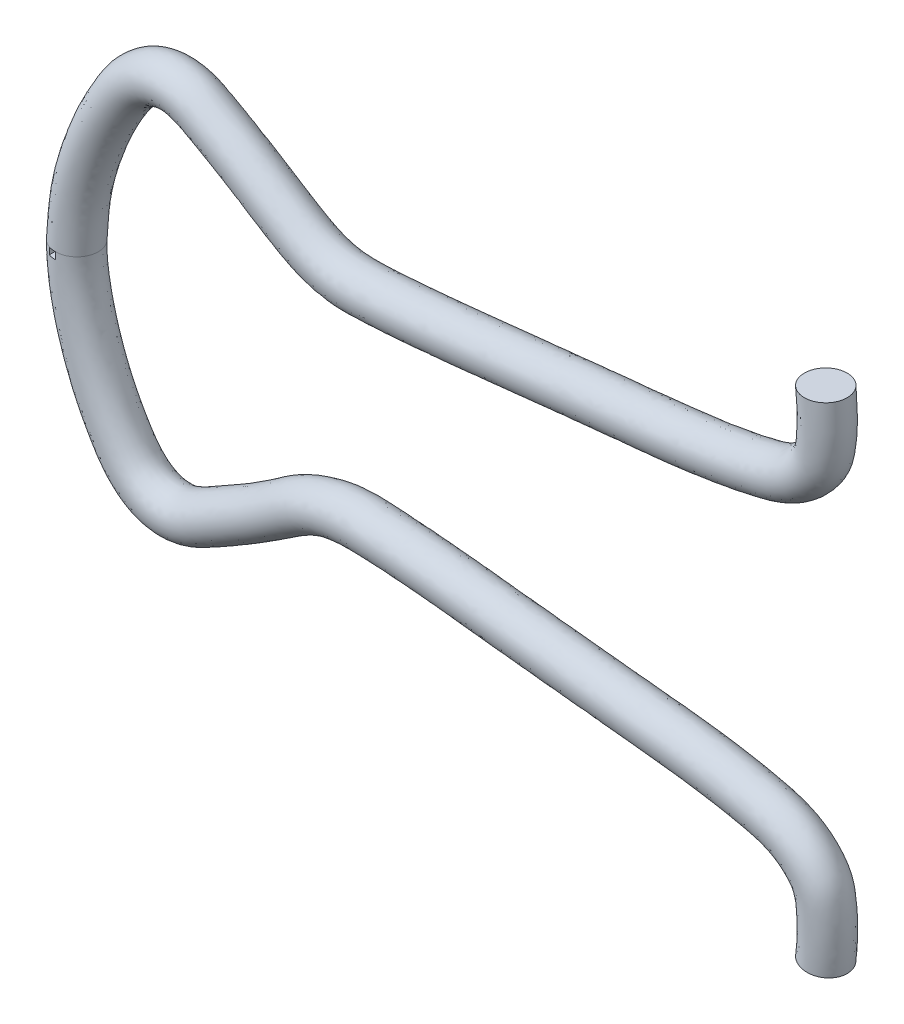
ISO-10303-21;
HEADER;
FILE_DESCRIPTION(('STEP AP214'),'2;1');
FILE_NAME('part.step','',(''),(''),'','','');
FILE_SCHEMA(('AUTOMOTIVE_DESIGN { 1 0 10303 214 1 1 1 1 }'));
ENDSEC;
DATA;
#1=APPLICATION_CONTEXT('core data for automotive mechanical design processes');
#2=APPLICATION_PROTOCOL_DEFINITION('international standard','automotive_design',2000,#1);
#3=PRODUCT_CONTEXT('',#1,'mechanical');
#4=PRODUCT('Part','Part','',(#3));
#5=PRODUCT_RELATED_PRODUCT_CATEGORY('part','',(#4));
#6=PRODUCT_DEFINITION_FORMATION('','',#4);
#7=PRODUCT_DEFINITION_CONTEXT('part definition',#1,'design');
#8=PRODUCT_DEFINITION('design','',#6,#7);
#9=PRODUCT_DEFINITION_SHAPE('','',#8);
#10=(LENGTH_UNIT() NAMED_UNIT(*) SI_UNIT(.MILLI.,.METRE.));
#11=(NAMED_UNIT(*) PLANE_ANGLE_UNIT() SI_UNIT($,.RADIAN.));
#12=(NAMED_UNIT(*) SI_UNIT($,.STERADIAN.) SOLID_ANGLE_UNIT());
#13=UNCERTAINTY_MEASURE_WITH_UNIT(LENGTH_MEASURE(1.E-05),#10,'distance_accuracy_value','');
#14=(GEOMETRIC_REPRESENTATION_CONTEXT(3) GLOBAL_UNCERTAINTY_ASSIGNED_CONTEXT((#13)) GLOBAL_UNIT_ASSIGNED_CONTEXT((#10,
#11,#12)) REPRESENTATION_CONTEXT('',''));
#15=CARTESIAN_POINT('',(0.,0.,0.));
#16=DIRECTION('',(0.,0.,1.));
#17=DIRECTION('',(1.,0.,0.));
#18=AXIS2_PLACEMENT_3D('',#15,#16,#17);
#19=CARTESIAN_POINT('',(-31.85024051314,-0.739097488164255,0.500000000000001));
#20=CARTESIAN_POINT('',(-31.8552836514389,-1.08239667611665,0.500000000000001));
#21=CARTESIAN_POINT('',(-31.762998352297,-1.82891605051562,0.500000000000001));
#22=CARTESIAN_POINT('',(-31.4962403182843,-2.75116930594545,0.500000000000001));
#23=CARTESIAN_POINT('',(-31.1759950504245,-3.5133129920374,0.500000000000001));
#24=CARTESIAN_POINT('',(-30.8753990149459,-4.06797425683743,0.500000000000001));
#25=CARTESIAN_POINT('',(-30.5438551123552,-4.59312531108531,0.500000000000001));
#26=CARTESIAN_POINT('',(-30.1407518570774,-4.92986578830265,0.500000000000001));
#27=CARTESIAN_POINT('',(-29.7519104905496,-5.05477061998919,0.500000000000001));
#28=CARTESIAN_POINT('',(-29.434703656947,-5.07208801477055,0.500000000000001));
#29=CARTESIAN_POINT('',(-29.1064110838216,-4.99467848917008,0.500000000000001));
#30=CARTESIAN_POINT('',(-28.7910258545782,-4.83290003807697,0.500000000000001));
#31=CARTESIAN_POINT('',(-28.1448465375935,-4.47368378659672,0.500000000000001));
#32=CARTESIAN_POINT('',(-27.3499380904424,-4.00696426362659,0.500000000000001));
#33=CARTESIAN_POINT('',(-26.4591769418779,-3.36125254782962,0.500000000000001));
#34=CARTESIAN_POINT('',(-25.5814715165167,-3.09137367913693,0.500000000000001));
#35=CARTESIAN_POINT('',(-24.0326679214186,-3.14931242023839,0.500000000000001));
#36=CARTESIAN_POINT('',(-21.8522938980267,-3.39559727821309,0.500000000000001));
#37=CARTESIAN_POINT('',(-18.8705827000946,-3.71590053426215,0.500000000000001));
#38=CARTESIAN_POINT('',(-16.6992209430342,-3.91923704277046,0.500000000000001));
#39=CARTESIAN_POINT('',(-15.4052937301609,-4.24688618944392,0.500000000000001));
#40=CARTESIAN_POINT('',(-15.0842496913342,-4.38022003763113,0.500000000000001));
#41=CARTESIAN_POINT('',(-14.8001560399814,-4.56601615733175,0.500000000000001));
#42=CARTESIAN_POINT('',(-14.5688398215693,-4.79232220348142,0.500000000000001));
#43=CARTESIAN_POINT('',(-14.3632827133004,-5.09906135302469,0.500000000000001));
#44=CARTESIAN_POINT('',(-14.3159188881753,-5.51757961624325,0.500000000000001));
#45=CARTESIAN_POINT('',(-14.2937130072287,-6.01054136016181,0.500000000000001));
#46=CARTESIAN_POINT('',(-14.3172112254019,-6.35500459542826,0.500000000000001));
#47=CARTESIAN_POINT('',(-14.3394388093002,-6.53926497638514,0.500000000000001));
#48=CARTESIAN_POINT('',(-32.855816893968,-0.739097488164255,0.499999999999999));
#49=CARTESIAN_POINT('',(-32.8608600322669,-1.08239667611665,0.499999999999999));
#50=CARTESIAN_POINT('',(-32.7461859213861,-2.11009620193032,0.499999999999999));
#51=CARTESIAN_POINT('',(-32.4436964154244,-3.08547609316605,0.499999999999999));
#52=CARTESIAN_POINT('',(-32.0815147340565,-3.95796491711765,0.499999999999999));
#53=CARTESIAN_POINT('',(-31.7289888008618,-4.59345533048722,0.499999999999999));
#54=CARTESIAN_POINT('',(-31.3597331451799,-5.21162386501684,0.499999999999999));
#55=CARTESIAN_POINT('',(-30.6398673090752,-5.83339109159899,0.499999999999999));
#56=CARTESIAN_POINT('',(-29.9282124544286,-6.05490192139046,0.499999999999999));
#57=CARTESIAN_POINT('',(-29.3373934949348,-6.08865817660507,0.499999999999999));
#58=CARTESIAN_POINT('',(-28.7089531632595,-5.92875474113626,0.499999999999999));
#59=CARTESIAN_POINT('',(-28.2930278474639,-5.70507262239239,0.499999999999999));
#60=CARTESIAN_POINT('',(-27.6386767057019,-5.34513572777799,0.499999999999999));
#61=CARTESIAN_POINT('',(-26.8261839958269,-4.85010496465445,0.499999999999999));
#62=CARTESIAN_POINT('',(-25.8558878577318,-4.20078673800262,0.499999999999999));
#63=CARTESIAN_POINT('',(-25.5370678803037,-4.12892079312087,0.499999999999999));
#64=CARTESIAN_POINT('',(-24.1716877775103,-4.12157036237866,0.499999999999999));
#65=CARTESIAN_POINT('',(-21.8999743022317,-4.41332766724705,0.499999999999999));
#66=CARTESIAN_POINT('',(-19.0664753376878,-4.69256266776707,0.499999999999999));
#67=CARTESIAN_POINT('',(-16.6392557181453,-4.96551142828545,0.499999999999999));
#68=CARTESIAN_POINT('',(-15.7111019676885,-5.20800931439875,0.499999999999999));
#69=CARTESIAN_POINT('',(-15.5489569868968,-5.2789206615397,0.499999999999999));
#70=CARTESIAN_POINT('',(-15.4293429949705,-5.35720949054591,0.499999999999999));
#71=CARTESIAN_POINT('',(-15.3383699621968,-5.45387224730796,0.499999999999999));
#72=CARTESIAN_POINT('',(-15.3226515082278,-5.47739093782235,0.499999999999999));
#73=CARTESIAN_POINT('',(-15.3305400172304,-5.51782824537994,0.499999999999999));
#74=CARTESIAN_POINT('',(-15.2986006944084,-6.04328885917275,0.499999999999999));
#75=CARTESIAN_POINT('',(-15.3154422594949,-6.23458660896315,0.499999999999999));
#76=CARTESIAN_POINT('',(-15.3376698433931,-6.41884698992003,0.499999999999999));
#77=CARTESIAN_POINT('',(-32.855816893968,-0.739097488164255,-0.500000000000002));
#78=CARTESIAN_POINT('',(-32.8608600322669,-1.08239667611665,-0.500000000000002));
#79=CARTESIAN_POINT('',(-32.7461859213861,-2.11009620193032,-0.500000000000002));
#80=CARTESIAN_POINT('',(-32.4436964154244,-3.08547609316605,-0.500000000000002));
#81=CARTESIAN_POINT('',(-32.0815147340565,-3.95796491711765,-0.500000000000002));
#82=CARTESIAN_POINT('',(-31.7289888008618,-4.59345533048722,-0.500000000000003));
#83=CARTESIAN_POINT('',(-31.3597331451799,-5.21162386501684,-0.500000000000002));
#84=CARTESIAN_POINT('',(-30.6398673090752,-5.83339109159899,-0.500000000000002));
#85=CARTESIAN_POINT('',(-29.9282124544286,-6.05490192139046,-0.500000000000002));
#86=CARTESIAN_POINT('',(-29.3373934949348,-6.08865817660507,-0.500000000000002));
#87=CARTESIAN_POINT('',(-28.7089531632595,-5.92875474113626,-0.500000000000002));
#88=CARTESIAN_POINT('',(-28.2930278474639,-5.70507262239239,-0.500000000000002));
#89=CARTESIAN_POINT('',(-27.6386767057019,-5.34513572777799,-0.500000000000002));
#90=CARTESIAN_POINT('',(-26.8261839958269,-4.85010496465445,-0.500000000000003));
#91=CARTESIAN_POINT('',(-25.8558878577318,-4.20078673800262,-0.500000000000002));
#92=CARTESIAN_POINT('',(-25.5370678803037,-4.12892079312087,-0.500000000000003));
#93=CARTESIAN_POINT('',(-24.1716877775103,-4.12157036237866,-0.500000000000002));
#94=CARTESIAN_POINT('',(-21.8999743022317,-4.41332766724705,-0.500000000000003));
#95=CARTESIAN_POINT('',(-19.0664753376878,-4.69256266776707,-0.500000000000002));
#96=CARTESIAN_POINT('',(-16.6392557181453,-4.96551142828545,-0.500000000000003));
#97=CARTESIAN_POINT('',(-15.7111019676885,-5.20800931439875,-0.500000000000002));
#98=CARTESIAN_POINT('',(-15.5489569868968,-5.2789206615397,-0.500000000000002));
#99=CARTESIAN_POINT('',(-15.4293429949705,-5.35720949054591,-0.500000000000002));
#100=CARTESIAN_POINT('',(-15.3383699621968,-5.45387224730796,-0.500000000000002));
#101=CARTESIAN_POINT('',(-15.3226515082278,-5.47739093782235,-0.500000000000002));
#102=CARTESIAN_POINT('',(-15.3305400172304,-5.51782824537994,-0.500000000000002));
#103=CARTESIAN_POINT('',(-15.2986006944084,-6.04328885917275,-0.500000000000002));
#104=CARTESIAN_POINT('',(-15.3154422594949,-6.23458660896315,-0.500000000000002));
#105=CARTESIAN_POINT('',(-15.3376698433931,-6.41884698992003,-0.500000000000002));
#106=CARTESIAN_POINT('',(-31.85024051314,-0.739097488164255,-0.500000000000001));
#107=CARTESIAN_POINT('',(-31.8552836514389,-1.08239667611665,-0.500000000000001));
#108=CARTESIAN_POINT('',(-31.762998352297,-1.82891605051562,-0.500000000000001));
#109=CARTESIAN_POINT('',(-31.4962403182843,-2.75116930594545,-0.500000000000001));
#110=CARTESIAN_POINT('',(-31.1759950504245,-3.5133129920374,-0.500000000000001));
#111=CARTESIAN_POINT('',(-30.8753990149459,-4.06797425683743,-0.500000000000001));
#112=CARTESIAN_POINT('',(-30.5438551123552,-4.59312531108531,-0.500000000000001));
#113=CARTESIAN_POINT('',(-30.1407518570774,-4.92986578830265,-0.500000000000001));
#114=CARTESIAN_POINT('',(-29.7519104905496,-5.05477061998919,-0.500000000000001));
#115=CARTESIAN_POINT('',(-29.434703656947,-5.07208801477055,-0.500000000000001));
#116=CARTESIAN_POINT('',(-29.1064110838216,-4.99467848917008,-0.500000000000001));
#117=CARTESIAN_POINT('',(-28.7910258545782,-4.83290003807697,-0.500000000000001));
#118=CARTESIAN_POINT('',(-28.1448465375935,-4.47368378659672,-0.500000000000001));
#119=CARTESIAN_POINT('',(-27.3499380904424,-4.00696426362659,-0.500000000000001));
#120=CARTESIAN_POINT('',(-26.4591769418779,-3.36125254782962,-0.500000000000001));
#121=CARTESIAN_POINT('',(-25.5814715165167,-3.09137367913693,-0.500000000000001));
#122=CARTESIAN_POINT('',(-24.0326679214186,-3.14931242023839,-0.500000000000001));
#123=CARTESIAN_POINT('',(-21.8522938980267,-3.39559727821309,-0.500000000000001));
#124=CARTESIAN_POINT('',(-18.8705827000946,-3.71590053426215,-0.500000000000001));
#125=CARTESIAN_POINT('',(-16.6992209430342,-3.91923704277046,-0.500000000000001));
#126=CARTESIAN_POINT('',(-15.4052937301609,-4.24688618944392,-0.500000000000001));
#127=CARTESIAN_POINT('',(-15.0842496913342,-4.38022003763113,-0.500000000000001));
#128=CARTESIAN_POINT('',(-14.8001560399814,-4.56601615733175,-0.500000000000001));
#129=CARTESIAN_POINT('',(-14.5688398215693,-4.79232220348142,-0.500000000000001));
#130=CARTESIAN_POINT('',(-14.3632827133004,-5.09906135302469,-0.500000000000001));
#131=CARTESIAN_POINT('',(-14.3159188881753,-5.51757961624325,-0.500000000000001));
#132=CARTESIAN_POINT('',(-14.2937130072287,-6.01054136016181,-0.500000000000001));
#133=CARTESIAN_POINT('',(-14.3172112254019,-6.35500459542826,-0.500000000000001));
#134=CARTESIAN_POINT('',(-14.3394388093002,-6.53926497638514,-0.500000000000001));
#135=CARTESIAN_POINT('',(-30.844664132312,-0.739097488164255,-0.499999999999999));
#136=CARTESIAN_POINT('',(-30.8497072706109,-1.08239667611665,-0.499999999999999));
#137=CARTESIAN_POINT('',(-30.7798107832079,-1.5477358991009,-0.499999999999999));
#138=CARTESIAN_POINT('',(-30.5487842211442,-2.41686251872486,-0.499999999999999));
#139=CARTESIAN_POINT('',(-30.2704753667924,-3.06866106695715,-0.499999999999999));
#140=CARTESIAN_POINT('',(-30.0218092290299,-3.54249318318764,-0.499999999999999));
#141=CARTESIAN_POINT('',(-29.7279770795306,-3.97462675715379,-0.499999999999999));
#142=CARTESIAN_POINT('',(-29.6416364050797,-4.02634048500629,-0.499999999999999));
#143=CARTESIAN_POINT('',(-29.5756085266706,-4.05463931858793,-0.499999999999999));
#144=CARTESIAN_POINT('',(-29.5320138189591,-4.05551785293601,-0.499999999999999));
#145=CARTESIAN_POINT('',(-29.5038690043837,-4.0606022372039,-0.499999999999999));
#146=CARTESIAN_POINT('',(-29.2890238616924,-3.96072745376155,-0.499999999999999));
#147=CARTESIAN_POINT('',(-28.6510163694851,-3.60223184541546,-0.499999999999999));
#148=CARTESIAN_POINT('',(-27.8736921850578,-3.16382356259872,-0.499999999999999));
#149=CARTESIAN_POINT('',(-27.062466026024,-2.52171835765664,-0.499999999999999));
#150=CARTESIAN_POINT('',(-25.6258751527298,-2.05382656515296,-0.499999999999999));
#151=CARTESIAN_POINT('',(-23.8936480653268,-2.17705447809813,-0.499999999999999));
#152=CARTESIAN_POINT('',(-21.8046134938217,-2.37786688917913,-0.499999999999999));
#153=CARTESIAN_POINT('',(-18.6746900625013,-2.73923840075723,-0.499999999999999));
#154=CARTESIAN_POINT('',(-16.7591861679231,-2.87296265725545,-0.499999999999999));
#155=CARTESIAN_POINT('',(-15.0994854926332,-3.28576306448908,-0.499999999999999));
#156=CARTESIAN_POINT('',(-14.6195423957717,-3.48151941372254,-0.499999999999999));
#157=CARTESIAN_POINT('',(-14.1709690849923,-3.77482282411758,-0.499999999999999));
#158=CARTESIAN_POINT('',(-13.7993096809417,-4.13077215965487,-0.499999999999999));
#159=CARTESIAN_POINT('',(-13.4039139183731,-4.72073176822702,-0.499999999999999));
#160=CARTESIAN_POINT('',(-13.3012977591202,-5.51733098710657,-0.499999999999999));
#161=CARTESIAN_POINT('',(-13.2888253200491,-5.97779386115087,-0.499999999999999));
#162=CARTESIAN_POINT('',(-13.318980191309,-6.47542258189337,-0.499999999999999));
#163=CARTESIAN_POINT('',(-13.3412077752072,-6.65968296285025,-0.499999999999999));
#164=CARTESIAN_POINT('',(-30.844664132312,-0.739097488164255,0.500000000000002));
#165=CARTESIAN_POINT('',(-30.8497072706109,-1.08239667611665,0.500000000000002));
#166=CARTESIAN_POINT('',(-30.7798107832079,-1.5477358991009,0.500000000000002));
#167=CARTESIAN_POINT('',(-30.5487842211442,-2.41686251872486,0.500000000000002));
#168=CARTESIAN_POINT('',(-30.2704753667924,-3.06866106695715,0.500000000000002));
#169=CARTESIAN_POINT('',(-30.0218092290299,-3.54249318318764,0.500000000000003));
#170=CARTESIAN_POINT('',(-29.7279770795306,-3.97462675715379,0.500000000000002));
#171=CARTESIAN_POINT('',(-29.6416364050797,-4.02634048500629,0.500000000000002));
#172=CARTESIAN_POINT('',(-29.5756085266706,-4.05463931858793,0.500000000000002));
#173=CARTESIAN_POINT('',(-29.5320138189591,-4.05551785293601,0.500000000000002));
#174=CARTESIAN_POINT('',(-29.5038690043837,-4.0606022372039,0.500000000000002));
#175=CARTESIAN_POINT('',(-29.2890238616924,-3.96072745376155,0.500000000000002));
#176=CARTESIAN_POINT('',(-28.6510163694851,-3.60223184541546,0.500000000000002));
#177=CARTESIAN_POINT('',(-27.8736921850578,-3.16382356259872,0.500000000000003));
#178=CARTESIAN_POINT('',(-27.062466026024,-2.52171835765664,0.500000000000002));
#179=CARTESIAN_POINT('',(-25.6258751527298,-2.05382656515296,0.500000000000002));
#180=CARTESIAN_POINT('',(-23.8936480653268,-2.17705447809813,0.500000000000002));
#181=CARTESIAN_POINT('',(-21.8046134938217,-2.37786688917913,0.500000000000003));
#182=CARTESIAN_POINT('',(-18.6746900625013,-2.73923840075723,0.500000000000002));
#183=CARTESIAN_POINT('',(-16.7591861679231,-2.87296265725545,0.500000000000003));
#184=CARTESIAN_POINT('',(-15.0994854926332,-3.28576306448908,0.500000000000002));
#185=CARTESIAN_POINT('',(-14.6195423957717,-3.48151941372254,0.500000000000002));
#186=CARTESIAN_POINT('',(-14.1709690849923,-3.77482282411758,0.500000000000002));
#187=CARTESIAN_POINT('',(-13.7993096809417,-4.13077215965487,0.500000000000002));
#188=CARTESIAN_POINT('',(-13.4039139183731,-4.72073176822702,0.500000000000002));
#189=CARTESIAN_POINT('',(-13.3012977591202,-5.51733098710657,0.500000000000002));
#190=CARTESIAN_POINT('',(-13.2888253200491,-5.97779386115087,0.500000000000002));
#191=CARTESIAN_POINT('',(-13.318980191309,-6.47542258189337,0.500000000000002));
#192=CARTESIAN_POINT('',(-13.3412077752072,-6.65968296285025,0.500000000000002));
#193=CARTESIAN_POINT('',(-31.85024051314,-0.739097488164255,0.500000000000001));
#194=CARTESIAN_POINT('',(-31.8552836514389,-1.08239667611665,0.500000000000001));
#195=CARTESIAN_POINT('',(-31.762998352297,-1.82891605051562,0.500000000000001));
#196=CARTESIAN_POINT('',(-31.4962403182843,-2.75116930594545,0.500000000000001));
#197=CARTESIAN_POINT('',(-31.1759950504245,-3.5133129920374,0.500000000000001));
#198=CARTESIAN_POINT('',(-30.8753990149459,-4.06797425683743,0.500000000000001));
#199=CARTESIAN_POINT('',(-30.5438551123552,-4.59312531108531,0.500000000000001));
#200=CARTESIAN_POINT('',(-30.1407518570774,-4.92986578830265,0.500000000000001));
#201=CARTESIAN_POINT('',(-29.7519104905496,-5.05477061998919,0.500000000000001));
#202=CARTESIAN_POINT('',(-29.434703656947,-5.07208801477055,0.500000000000001));
#203=CARTESIAN_POINT('',(-29.1064110838216,-4.99467848917008,0.500000000000001));
#204=CARTESIAN_POINT('',(-28.7910258545782,-4.83290003807697,0.500000000000001));
#205=CARTESIAN_POINT('',(-28.1448465375935,-4.47368378659672,0.500000000000001));
#206=CARTESIAN_POINT('',(-27.3499380904424,-4.00696426362659,0.500000000000001));
#207=CARTESIAN_POINT('',(-26.4591769418779,-3.36125254782962,0.500000000000001));
#208=CARTESIAN_POINT('',(-25.5814715165167,-3.09137367913693,0.500000000000001));
#209=CARTESIAN_POINT('',(-24.0326679214186,-3.14931242023839,0.500000000000001));
#210=CARTESIAN_POINT('',(-21.8522938980267,-3.39559727821309,0.500000000000001));
#211=CARTESIAN_POINT('',(-18.8705827000946,-3.71590053426215,0.500000000000001));
#212=CARTESIAN_POINT('',(-16.6992209430342,-3.91923704277046,0.500000000000001));
#213=CARTESIAN_POINT('',(-15.4052937301609,-4.24688618944392,0.500000000000001));
#214=CARTESIAN_POINT('',(-15.0842496913342,-4.38022003763113,0.500000000000001));
#215=CARTESIAN_POINT('',(-14.8001560399814,-4.56601615733175,0.500000000000001));
#216=CARTESIAN_POINT('',(-14.5688398215693,-4.79232220348142,0.500000000000001));
#217=CARTESIAN_POINT('',(-14.3632827133004,-5.09906135302469,0.500000000000001));
#218=CARTESIAN_POINT('',(-14.3159188881753,-5.51757961624325,0.500000000000001));
#219=CARTESIAN_POINT('',(-14.2937130072287,-6.01054136016181,0.500000000000001));
#220=CARTESIAN_POINT('',(-14.3172112254019,-6.35500459542826,0.500000000000001));
#221=CARTESIAN_POINT('',(-14.3394388093002,-6.53926497638514,0.500000000000001));
#222=(BOUNDED_SURFACE() B_SPLINE_SURFACE(3,3,((#19,#20,#21,#22,#23,#24,#25,#26,#27,#28,#29,#30,
#31,#32,#33,#34,#35,#36,#37,#38,#39,#40,#41,#42,#43,#44,#45,#46,#47),(#48,#49,#50,#51,#52,#53,
#54,#55,#56,#57,#58,#59,#60,#61,#62,#63,#64,#65,#66,#67,#68,#69,#70,#71,#72,#73,#74,#75,#76),
(#77,#78,#79,#80,#81,#82,#83,#84,#85,#86,#87,#88,#89,#90,#91,#92,#93,#94,#95,#96,#97,#98,#99,
#100,#101,#102,#103,#104,#105),(#106,#107,#108,#109,#110,#111,#112,#113,#114,#115,#116,#117,
#118,#119,#120,#121,#122,#123,#124,#125,#126,#127,#128,#129,#130,#131,#132,#133,#134),(#135,
#136,#137,#138,#139,#140,#141,#142,#143,#144,#145,#146,#147,#148,#149,#150,#151,#152,#153,#154,
#155,#156,#157,#158,#159,#160,#161,#162,#163),(#164,#165,#166,#167,#168,#169,#170,#171,#172,
#173,#174,#175,#176,#177,#178,#179,#180,#181,#182,#183,#184,#185,#186,#187,#188,#189,#190,#191,
#192),(#193,#194,#195,#196,#197,#198,#199,#200,#201,#202,#203,#204,#205,#206,#207,#208,#209,
#210,#211,#212,#213,#214,#215,#216,#217,#218,#219,#220,#221)),.UNSPECIFIED.,.T.,.F.,
.F.) B_SPLINE_SURFACE_WITH_KNOTS((4,3,4),(4,1,1,1,1,1,1,1,1,1,1,1,1,1,1,1,1,1,1,1,1,1,1,1,1,1,
4),(0.,0.5,1.),(0.,0.0453080663909508,0.0984238556094882,0.126301054122408,0.154230019640889,
0.18162996670079,0.207998463452138,0.221300453837338,0.234929916301715,0.249422386694303,
0.265217720548691,0.281542247278561,0.347049926004407,0.386829289422081,0.426042239288472,
0.465314949180757,0.590141791791185,0.71605840505547,0.861263029247658,0.876769672795154,
0.891970414615276,0.90691782362175,0.921248219665531,0.934536313034606,0.954674024957773,
0.975507958500653,1.),
.UNSPECIFIED.) GEOMETRIC_REPRESENTATION_ITEM() RATIONAL_B_SPLINE_SURFACE(((1.,1.,1.,1.,1.,1.,1.,
1.,1.,1.,1.,1.,1.,1.,1.,1.,1.,1.,1.,1.,1.,1.,1.,1.,1.,1.,1.,1.,1.),(0.333333333333333,
0.333333333333333,0.333333333333333,0.333333333333333,0.333333333333333,0.333333333333333,
0.333333333333333,0.333333333333333,0.333333333333333,0.333333333333333,0.333333333333333,
0.333333333333333,0.333333333333333,0.333333333333333,0.333333333333333,0.333333333333333,
0.333333333333333,0.333333333333333,0.333333333333334,0.333333333333333,0.333333333333333,
0.333333333333333,0.333333333333333,0.333333333333333,0.333333333333333,0.333333333333333,
0.333333333333333,0.333333333333333,0.333333333333333),(0.333333333333333,0.333333333333333,
0.333333333333333,0.333333333333333,0.333333333333333,0.333333333333333,0.333333333333333,
0.333333333333333,0.333333333333333,0.333333333333333,0.333333333333333,0.333333333333333,
0.333333333333333,0.333333333333333,0.333333333333333,0.333333333333333,0.333333333333333,
0.333333333333333,0.333333333333334,0.333333333333333,0.333333333333333,0.333333333333333,
0.333333333333333,0.333333333333333,0.333333333333333,0.333333333333333,0.333333333333333,
0.333333333333333,0.333333333333333),(1.,1.,1.,1.,1.,1.,1.,1.,1.,1.,1.,1.,1.,1.,1.,1.,1.,1.,1.,
1.,1.,1.,1.,1.,1.,1.,1.,1.,1.),(0.333333333333333,0.333333333333333,0.333333333333333,
0.333333333333333,0.333333333333333,0.333333333333333,0.333333333333333,0.333333333333333,
0.333333333333333,0.333333333333333,0.333333333333333,0.333333333333333,0.333333333333333,
0.333333333333333,0.333333333333333,0.333333333333333,0.333333333333333,0.333333333333333,
0.333333333333334,0.333333333333333,0.333333333333333,0.333333333333333,0.333333333333333,
0.333333333333333,0.333333333333333,0.333333333333333,0.333333333333333,0.333333333333333,
0.333333333333333),(0.333333333333333,0.333333333333333,0.333333333333333,0.333333333333333,
0.333333333333333,0.333333333333333,0.333333333333333,0.333333333333333,0.333333333333333,
0.333333333333333,0.333333333333333,0.333333333333333,0.333333333333333,0.333333333333333,
0.333333333333333,0.333333333333333,0.333333333333333,0.333333333333333,0.333333333333334,
0.333333333333333,0.333333333333333,0.333333333333333,0.333333333333333,0.333333333333333,
0.333333333333333,0.333333333333333,0.333333333333333,0.333333333333333,0.333333333333333),(1.,
1.,1.,1.,1.,1.,1.,1.,1.,1.,1.,1.,1.,1.,1.,1.,1.,1.,1.,1.,1.,1.,1.,1.,1.,1.,1.,1.,1.))) REPRESENTATION_ITEM('') SURFACE());
#223=CARTESIAN_POINT('',(-14.3394388093002,-6.53926497638514,0.500000000000001));
#224=CARTESIAN_POINT('',(-15.3376698433931,-6.41884698992003,0.499999999999999));
#225=CARTESIAN_POINT('',(-15.3376698433931,-6.41884698992003,-0.500000000000002));
#226=CARTESIAN_POINT('',(-14.3394388093002,-6.53926497638514,-0.500000000000001));
#227=CARTESIAN_POINT('',(-13.3412077752072,-6.65968296285025,-0.499999999999999));
#228=CARTESIAN_POINT('',(-13.3412077752072,-6.65968296285025,0.500000000000002));
#229=CARTESIAN_POINT('',(-14.3394388093002,-6.53926497638514,0.500000000000001));
#230=(BOUNDED_CURVE() B_SPLINE_CURVE(3,(#223,#224,#225,#226,#227,#228,#229),.UNSPECIFIED.,.T.,
.F.) B_SPLINE_CURVE_WITH_KNOTS((4,3,4),(0.,0.5,1.),
.UNSPECIFIED.) CURVE() GEOMETRIC_REPRESENTATION_ITEM() RATIONAL_B_SPLINE_CURVE((1.,
0.333333333333333,0.333333333333333,1.,0.333333333333333,0.333333333333333,1.)) REPRESENTATION_ITEM(''));
#231=CARTESIAN_POINT('',(-14.3394388093002,-6.53926497638514,0.500000000000001));
#232=VERTEX_POINT('',#231);
#233=EDGE_CURVE('E88',#232,#232,#230,.F.);
#234=CARTESIAN_POINT('',(-31.85024051314,-0.900710289289549,0.499998913472939));
#235=CARTESIAN_POINT('',(-31.8792338995687,-0.900710289289549,0.499904339239247));
#236=CARTESIAN_POINT('',(-31.9078072658661,-0.900710289289549,0.497401733195915));
#237=CARTESIAN_POINT('',(-31.9641139581979,-0.900710289289549,0.487580457489969));
#238=CARTESIAN_POINT('',(-31.9918472842325,-0.900710289289549,0.480261787827354));
#239=CARTESIAN_POINT('',(-32.0191605901357,-0.900710289289549,0.470535086355099));
#240=B_SPLINE_CURVE_WITH_KNOTS('',3,(#234,#235,#236,#237,#238,#239),.UNSPECIFIED.,.F.,.F.,(4,2,
4),(0.,0.0860482578970775,0.172096515794165),.UNSPECIFIED.);
#241=CARTESIAN_POINT('',(-31.85024051314,-0.900710289289549,0.499998913472939));
#242=VERTEX_POINT('',#241);
#243=CARTESIAN_POINT('',(-32.0191605901357,-0.900710289289549,0.470535086355097));
#244=VERTEX_POINT('',#243);
#245=EDGE_CURVE('E51',#242,#244,#240,.T.);
#246=CARTESIAN_POINT('',(-32.0191605901357,-0.900710289289549,0.470535086355097));
#247=CARTESIAN_POINT('',(-32.0191605901357,-0.87377532710775,0.470805026393329));
#248=CARTESIAN_POINT('',(-32.0191605901357,-0.846840112589742,0.470973483926086));
#249=CARTESIAN_POINT('',(-32.0191605901357,-0.792969178881311,0.47110743398065));
#250=CARTESIAN_POINT('',(-32.0191605901357,-0.766033459690887,0.471072926502457));
#251=CARTESIAN_POINT('',(-32.0191605901357,-0.739097488164255,0.470936936518789));
#252=B_SPLINE_CURVE_WITH_KNOTS('',3,(#246,#247,#248,#249,#250,#251),.UNSPECIFIED.,.F.,.F.,(4,2,
4),(0.,0.0808072238827864,0.161614447765573),.UNSPECIFIED.);
#253=CARTESIAN_POINT('',(-32.0191605901357,-0.739097488164272,0.470936936518791));
#254=VERTEX_POINT('',#253);
#255=EDGE_CURVE('E11',#244,#254,#252,.T.);
#256=CARTESIAN_POINT('',(-31.85024051314,-0.739097488164272,0.500000000000001));
#257=CARTESIAN_POINT('',(-30.844664132312,-0.739097488164272,0.500000000000002));
#258=CARTESIAN_POINT('',(-30.844664132312,-0.739097488164272,-0.499999999999999));
#259=CARTESIAN_POINT('',(-31.85024051314,-0.739097488164272,-0.500000000000001));
#260=CARTESIAN_POINT('',(-32.855816893968,-0.739097488164272,-0.500000000000002));
#261=CARTESIAN_POINT('',(-32.855816893968,-0.739097488164272,0.499999999999999));
#262=CARTESIAN_POINT('',(-31.85024051314,-0.739097488164272,0.500000000000001));
#263=(BOUNDED_CURVE() B_SPLINE_CURVE(3,(#256,#257,#258,#259,#260,#261,#262),.UNSPECIFIED.,.T.,
.F.) B_SPLINE_CURVE_WITH_KNOTS((4,3,4),(0.,0.5,1.),
.UNSPECIFIED.) CURVE() GEOMETRIC_REPRESENTATION_ITEM() RATIONAL_B_SPLINE_CURVE((1.,
0.333333333333333,0.333333333333333,1.,0.333333333333333,0.333333333333333,1.)) REPRESENTATION_ITEM(''));
#264=CARTESIAN_POINT('',(-31.85024051314,-0.739097488164272,0.500000000000001));
#265=VERTEX_POINT('',#264);
#266=EDGE_CURVE('E115',#254,#265,#263,.F.);
#267=CARTESIAN_POINT('',(-31.85024051314,-0.739097488164255,0.500000000000001));
#268=CARTESIAN_POINT('',(-31.85024051314,-0.792968421872686,0.499999637824313));
#269=CARTESIAN_POINT('',(-31.85024051314,-0.846839355581117,0.499999275648626));
#270=CARTESIAN_POINT('',(-31.85024051314,-0.900710289289548,0.499998913472939));
#271=B_SPLINE_CURVE_WITH_KNOTS('',3,(#267,#268,#269,#270),.UNSPECIFIED.,.F.,.F.,(4,4),(0.,
0.161612801128946),.UNSPECIFIED.);
#272=EDGE_CURVE('E129',#265,#242,#271,.T.);
#273=ORIENTED_EDGE('',*,*,#233,.T.);
#274=EDGE_LOOP('',(#273));
#275=FACE_BOUND('',#274,.T.);
#276=ORIENTED_EDGE('',*,*,#245,.T.);
#277=ORIENTED_EDGE('',*,*,#255,.T.);
#278=ORIENTED_EDGE('',*,*,#266,.T.);
#279=ORIENTED_EDGE('',*,*,#272,.T.);
#280=EDGE_LOOP('',(#276,#277,#278,#279));
#281=FACE_BOUND('',#280,.T.);
#282=ADVANCED_FACE('F35',(#275,#281),#222,.T.);
#283=CARTESIAN_POINT('',(-14.3394388093003,5.0610700000566,0.500000000000001));
#284=CARTESIAN_POINT('',(-14.3226369011048,4.87585362633113,0.500000000000001));
#285=CARTESIAN_POINT('',(-14.2915434940782,4.53309445700043,0.500000000000001));
#286=CARTESIAN_POINT('',(-14.3165998340043,4.03716283399738,0.500000000000001));
#287=CARTESIAN_POINT('',(-14.3632149031121,3.62114317305821,0.500000000000001));
#288=CARTESIAN_POINT('',(-14.5682955545628,3.31476114783015,0.500000000000001));
#289=CARTESIAN_POINT('',(-14.8001328153921,3.08780464432725,0.500000000000001));
#290=CARTESIAN_POINT('',(-15.0841477887947,2.90209178436403,0.500000000000001));
#291=CARTESIAN_POINT('',(-15.4052290602466,2.76870626181536,0.500000000000001));
#292=CARTESIAN_POINT('',(-16.6991187663411,2.44105910117381,0.500000000000001));
#293=CARTESIAN_POINT('',(-18.8690480411459,2.23859244204819,0.500000000000001));
#294=CARTESIAN_POINT('',(-21.8570604281007,1.91467955174071,0.500000000000001));
#295=CARTESIAN_POINT('',(-24.1001932213707,1.66953205247261,0.500000000000001));
#296=CARTESIAN_POINT('',(-25.845814600817,1.5959766927713,0.500000000000001));
#297=CARTESIAN_POINT('',(-26.8640883444268,2.17947335405573,0.500000000000001));
#298=CARTESIAN_POINT('',(-27.6402347271901,2.6877126726369,0.500000000000001));
#299=CARTESIAN_POINT('',(-28.2693337611829,3.06328842528765,0.500000000000001));
#300=CARTESIAN_POINT('',(-28.7200529265025,3.31567283747741,0.500000000000001));
#301=CARTESIAN_POINT('',(-29.156738914701,3.55113512734451,0.500000000000001));
#302=CARTESIAN_POINT('',(-29.6235658427914,3.60847620897366,0.500000000000001));
#303=CARTESIAN_POINT('',(-30.1085853111176,3.47818818606518,0.500000000000001));
#304=CARTESIAN_POINT('',(-30.5436580292458,3.1152697202054,0.500000000000001));
#305=CARTESIAN_POINT('',(-30.8753259317095,2.5897260096026,0.500000000000001));
#306=CARTESIAN_POINT('',(-31.1764051393912,2.0351321454019,0.5));
#307=CARTESIAN_POINT('',(-31.4940765415413,1.27298248895615,0.500000000000001));
#308=CARTESIAN_POINT('',(-31.7784764249727,0.350609882278038,0.500000000000001));
#309=CARTESIAN_POINT('',(-31.8276186040352,-0.395593352398396,0.500000000000001));
#310=CARTESIAN_POINT('',(-31.85024051314,-0.739097488164272,0.500000000000001));
#311=CARTESIAN_POINT('',(-13.3394388093003,5.0610700000566,0.500000000000001));
#312=CARTESIAN_POINT('',(-13.3260342543864,4.83056246152815,0.500000000000001));
#313=CARTESIAN_POINT('',(-13.3012279480372,4.40398801326915,0.500000000000001));
#314=CARTESIAN_POINT('',(-13.3143022626568,3.9204109821876,0.500000000000001));
#315=CARTESIAN_POINT('',(-13.4552050857614,3.14631112333896,0.500000000000001));
#316=CARTESIAN_POINT('',(-13.8726538279985,2.58377006080122,0.500000000000001));
#317=CARTESIAN_POINT('',(-14.2527814127606,2.2445450006871,0.500000000000001));
#318=CARTESIAN_POINT('',(-14.7053299704767,1.96987757366561,0.500000000000001));
#319=CARTESIAN_POINT('',(-15.1848217178946,1.78990562765307,0.500000000000001));
#320=CARTESIAN_POINT('',(-16.8295822447148,1.41042342428557,0.5));
#321=CARTESIAN_POINT('',(-18.7474513928644,1.25104912341622,0.500000000000001));
#322=CARTESIAN_POINT('',(-21.9033995787159,0.908331183136855,0.500000000000001));
#323=CARTESIAN_POINT('',(-23.9647206097735,0.675904634856589,0.500000000000001));
#324=CARTESIAN_POINT('',(-26.0741266723721,0.585462658943575,0.500000000000001));
#325=CARTESIAN_POINT('',(-27.5568594180182,1.42793145550721,0.500000000000002));
#326=CARTESIAN_POINT('',(-28.2154475089771,1.86963448558289,0.500000000000001));
#327=CARTESIAN_POINT('',(-28.818504810881,2.22384900258014,0.500000000000003));
#328=CARTESIAN_POINT('',(-29.2673826031648,2.47988967029696,0.500000000000002));
#329=CARTESIAN_POINT('',(-29.5690406987472,2.61295414748414,0.500000000000003));
#330=CARTESIAN_POINT('',(-29.5843642037957,2.57695658305815,0.500000000000003));
#331=CARTESIAN_POINT('',(-29.6631369443867,2.5439316588737,0.500000000000003));
#332=CARTESIAN_POINT('',(-29.7436526991601,2.47726082097618,0.500000000000003));
#333=CARTESIAN_POINT('',(-30.0332947537072,2.04898568784178,0.500000000000004));
#334=CARTESIAN_POINT('',(-30.2782398072946,1.5789304021186,0.500000000000003));
#335=CARTESIAN_POINT('',(-30.5501166925549,0.925903751416365,0.500000000000001));
#336=CARTESIAN_POINT('',(-30.793390973504,0.106120376005919,0.500000000000002));
#337=CARTESIAN_POINT('',(-30.8285014976616,-0.472662810524334,0.500000000000002));
#338=CARTESIAN_POINT('',(-30.844664132312,-0.739097488164272,0.500000000000002));
#339=CARTESIAN_POINT('',(-13.3394388093003,5.0610700000566,-0.500000000000001));
#340=CARTESIAN_POINT('',(-13.3260342543864,4.83056246152815,-0.500000000000001));
#341=CARTESIAN_POINT('',(-13.3012279480372,4.40398801326915,-0.500000000000001));
#342=CARTESIAN_POINT('',(-13.3143022626568,3.9204109821876,-0.5));
#343=CARTESIAN_POINT('',(-13.4552050857614,3.14631112333896,-0.500000000000001));
#344=CARTESIAN_POINT('',(-13.8726538279985,2.58377006080122,-0.5));
#345=CARTESIAN_POINT('',(-14.2527814127606,2.2445450006871,-0.500000000000001));
#346=CARTESIAN_POINT('',(-14.7053299704767,1.96987757366561,-0.500000000000001));
#347=CARTESIAN_POINT('',(-15.1848217178946,1.78990562765307,-0.500000000000001));
#348=CARTESIAN_POINT('',(-16.8295822447148,1.41042342428557,-0.500000000000001));
#349=CARTESIAN_POINT('',(-18.7474513928644,1.25104912341622,-0.5));
#350=CARTESIAN_POINT('',(-21.9033995787159,0.908331183136855,-0.500000000000001));
#351=CARTESIAN_POINT('',(-23.9647206097735,0.675904634856589,-0.5));
#352=CARTESIAN_POINT('',(-26.0741266723721,0.585462658943575,-0.5));
#353=CARTESIAN_POINT('',(-27.5568594180182,1.42793145550721,-0.499999999999999));
#354=CARTESIAN_POINT('',(-28.2154475089771,1.86963448558289,-0.5));
#355=CARTESIAN_POINT('',(-28.818504810881,2.22384900258014,-0.499999999999999));
#356=CARTESIAN_POINT('',(-29.2673826031648,2.47988967029696,-0.499999999999999));
#357=CARTESIAN_POINT('',(-29.5690406987472,2.61295414748414,-0.499999999999998));
#358=CARTESIAN_POINT('',(-29.5843642037957,2.57695658305815,-0.499999999999998));
#359=CARTESIAN_POINT('',(-29.6631369443867,2.5439316588737,-0.499999999999998));
#360=CARTESIAN_POINT('',(-29.7436526991601,2.47726082097618,-0.499999999999999));
#361=CARTESIAN_POINT('',(-30.0332947537072,2.04898568784178,-0.499999999999997));
#362=CARTESIAN_POINT('',(-30.2782398072946,1.5789304021186,-0.499999999999999));
#363=CARTESIAN_POINT('',(-30.5501166925549,0.925903751416365,-0.5));
#364=CARTESIAN_POINT('',(-30.793390973504,0.106120376005919,-0.5));
#365=CARTESIAN_POINT('',(-30.8285014976616,-0.472662810524334,-0.499999999999999));
#366=CARTESIAN_POINT('',(-30.844664132312,-0.739097488164272,-0.499999999999999));
#367=CARTESIAN_POINT('',(-14.3394388093003,5.0610700000566,-0.500000000000001));
#368=CARTESIAN_POINT('',(-14.3226369011048,4.87585362633113,-0.500000000000001));
#369=CARTESIAN_POINT('',(-14.2915434940782,4.53309445700043,-0.500000000000001));
#370=CARTESIAN_POINT('',(-14.3165998340043,4.03716283399738,-0.500000000000001));
#371=CARTESIAN_POINT('',(-14.3632149031121,3.62114317305821,-0.500000000000001));
#372=CARTESIAN_POINT('',(-14.5682955545628,3.31476114783015,-0.500000000000001));
#373=CARTESIAN_POINT('',(-14.8001328153921,3.08780464432725,-0.500000000000001));
#374=CARTESIAN_POINT('',(-15.0841477887947,2.90209178436403,-0.500000000000001));
#375=CARTESIAN_POINT('',(-15.4052290602466,2.76870626181536,-0.500000000000001));
#376=CARTESIAN_POINT('',(-16.6991187663411,2.44105910117381,-0.500000000000001));
#377=CARTESIAN_POINT('',(-18.8690480411459,2.23859244204819,-0.500000000000001));
#378=CARTESIAN_POINT('',(-21.8570604281007,1.91467955174071,-0.500000000000001));
#379=CARTESIAN_POINT('',(-24.1001932213707,1.66953205247261,-0.500000000000001));
#380=CARTESIAN_POINT('',(-25.845814600817,1.5959766927713,-0.500000000000001));
#381=CARTESIAN_POINT('',(-26.8640883444268,2.17947335405573,-0.500000000000001));
#382=CARTESIAN_POINT('',(-27.6402347271901,2.6877126726369,-0.500000000000001));
#383=CARTESIAN_POINT('',(-28.2693337611829,3.06328842528765,-0.500000000000001));
#384=CARTESIAN_POINT('',(-28.7200529265025,3.31567283747741,-0.500000000000001));
#385=CARTESIAN_POINT('',(-29.156738914701,3.55113512734451,-0.500000000000001));
#386=CARTESIAN_POINT('',(-29.6235658427914,3.60847620897366,-0.500000000000001));
#387=CARTESIAN_POINT('',(-30.1085853111176,3.47818818606518,-0.500000000000001));
#388=CARTESIAN_POINT('',(-30.5436580292458,3.1152697202054,-0.500000000000001));
#389=CARTESIAN_POINT('',(-30.8753259317095,2.5897260096026,-0.500000000000001));
#390=CARTESIAN_POINT('',(-31.1764051393912,2.0351321454019,-0.5));
#391=CARTESIAN_POINT('',(-31.4940765415413,1.27298248895615,-0.500000000000001));
#392=CARTESIAN_POINT('',(-31.7784764249727,0.350609882278038,-0.500000000000001));
#393=CARTESIAN_POINT('',(-31.8276186040352,-0.395593352398396,-0.500000000000001));
#394=CARTESIAN_POINT('',(-31.85024051314,-0.739097488164272,-0.500000000000001));
#395=CARTESIAN_POINT('',(-15.3394388093003,5.0610700000566,-0.500000000000001));
#396=CARTESIAN_POINT('',(-15.3192395478233,4.92114479113411,-0.500000000000001));
#397=CARTESIAN_POINT('',(-15.2818590401192,4.66220090073172,-0.500000000000001));
#398=CARTESIAN_POINT('',(-15.3188974053517,4.15391468580716,-0.500000000000001));
#399=CARTESIAN_POINT('',(-15.2712247204628,4.09597522277745,-0.500000000000001));
#400=CARTESIAN_POINT('',(-15.2639372811271,4.04575223485908,-0.500000000000001));
#401=CARTESIAN_POINT('',(-15.3474842180235,3.93106428796741,-0.500000000000001));
#402=CARTESIAN_POINT('',(-15.4629656071127,3.83430599506244,-0.500000000000001));
#403=CARTESIAN_POINT('',(-15.6256364025985,3.74750689597765,-0.500000000000001));
#404=CARTESIAN_POINT('',(-16.5686552879675,3.47169477806207,-0.5));
#405=CARTESIAN_POINT('',(-18.9906446894274,3.22613576068014,-0.500000000000001));
#406=CARTESIAN_POINT('',(-21.8107212774854,2.92102792034456,-0.500000000000001));
#407=CARTESIAN_POINT('',(-24.2356658329678,2.66315947008863,-0.500000000000001));
#408=CARTESIAN_POINT('',(-25.6175025292618,2.60649072659902,-0.500000000000001));
#409=CARTESIAN_POINT('',(-26.1713172708355,2.93101525260426,-0.500000000000002));
#410=CARTESIAN_POINT('',(-27.0650219454032,3.50579085969091,-0.500000000000001));
#411=CARTESIAN_POINT('',(-27.7201627114847,3.90272784799514,-0.500000000000003));
#412=CARTESIAN_POINT('',(-28.1727232498403,4.15145600465788,-0.500000000000003));
#413=CARTESIAN_POINT('',(-28.7444371306548,4.48931610720487,-0.500000000000003));
#414=CARTESIAN_POINT('',(-29.6627674817872,4.63999583488918,-0.500000000000003));
#415=CARTESIAN_POINT('',(-30.5540336778485,4.41244471325666,-0.500000000000003));
#416=CARTESIAN_POINT('',(-31.3436633593315,3.75327861943461,-0.500000000000003));
#417=CARTESIAN_POINT('',(-31.7173571097117,3.13046633136341,-0.500000000000004));
#418=CARTESIAN_POINT('',(-32.0745704714877,2.49133388868519,-0.500000000000003));
#419=CARTESIAN_POINT('',(-32.4380363905277,1.62006122649595,-0.500000000000002));
#420=CARTESIAN_POINT('',(-32.7635618764413,0.595099388550156,-0.500000000000002));
#421=CARTESIAN_POINT('',(-32.8267357104089,-0.318523894272458,-0.500000000000002));
#422=CARTESIAN_POINT('',(-32.855816893968,-0.739097488164272,-0.500000000000002));
#423=CARTESIAN_POINT('',(-15.3394388093003,5.0610700000566,0.500000000000001));
#424=CARTESIAN_POINT('',(-15.3192395478233,4.92114479113411,0.500000000000001));
#425=CARTESIAN_POINT('',(-15.2818590401192,4.66220090073172,0.500000000000001));
#426=CARTESIAN_POINT('',(-15.3188974053517,4.15391468580716,0.500000000000001));
#427=CARTESIAN_POINT('',(-15.2712247204628,4.09597522277745,0.500000000000001));
#428=CARTESIAN_POINT('',(-15.2639372811271,4.04575223485908,0.500000000000001));
#429=CARTESIAN_POINT('',(-15.3474842180235,3.93106428796741,0.500000000000001));
#430=CARTESIAN_POINT('',(-15.4629656071127,3.83430599506244,0.500000000000001));
#431=CARTESIAN_POINT('',(-15.6256364025985,3.74750689597765,0.5));
#432=CARTESIAN_POINT('',(-16.5686552879675,3.47169477806207,0.500000000000001));
#433=CARTESIAN_POINT('',(-18.9906446894274,3.22613576068014,0.5));
#434=CARTESIAN_POINT('',(-21.8107212774854,2.92102792034456,0.500000000000001));
#435=CARTESIAN_POINT('',(-24.2356658329678,2.66315947008863,0.5));
#436=CARTESIAN_POINT('',(-25.6175025292618,2.60649072659902,0.5));
#437=CARTESIAN_POINT('',(-26.1713172708355,2.93101525260426,0.499999999999999));
#438=CARTESIAN_POINT('',(-27.0650219454032,3.50579085969091,0.5));
#439=CARTESIAN_POINT('',(-27.7201627114847,3.90272784799514,0.499999999999999));
#440=CARTESIAN_POINT('',(-28.1727232498403,4.15145600465788,0.499999999999999));
#441=CARTESIAN_POINT('',(-28.7444371306548,4.48931610720487,0.499999999999998));
#442=CARTESIAN_POINT('',(-29.6627674817872,4.63999583488918,0.499999999999999));
#443=CARTESIAN_POINT('',(-30.5540336778485,4.41244471325666,0.499999999999998));
#444=CARTESIAN_POINT('',(-31.3436633593315,3.75327861943461,0.499999999999999));
#445=CARTESIAN_POINT('',(-31.7173571097117,3.13046633136341,0.499999999999997));
#446=CARTESIAN_POINT('',(-32.0745704714877,2.49133388868519,0.499999999999999));
#447=CARTESIAN_POINT('',(-32.4380363905277,1.62006122649595,0.5));
#448=CARTESIAN_POINT('',(-32.7635618764413,0.595099388550156,0.5));
#449=CARTESIAN_POINT('',(-32.8267357104089,-0.318523894272458,0.499999999999999));
#450=CARTESIAN_POINT('',(-32.855816893968,-0.739097488164272,0.499999999999999));
#451=CARTESIAN_POINT('',(-14.3394388093003,5.0610700000566,0.500000000000001));
#452=CARTESIAN_POINT('',(-14.3226369011048,4.87585362633113,0.500000000000001));
#453=CARTESIAN_POINT('',(-14.2915434940782,4.53309445700043,0.500000000000001));
#454=CARTESIAN_POINT('',(-14.3165998340043,4.03716283399738,0.500000000000001));
#455=CARTESIAN_POINT('',(-14.3632149031121,3.62114317305821,0.500000000000001));
#456=CARTESIAN_POINT('',(-14.5682955545628,3.31476114783015,0.500000000000001));
#457=CARTESIAN_POINT('',(-14.8001328153921,3.08780464432725,0.500000000000001));
#458=CARTESIAN_POINT('',(-15.0841477887947,2.90209178436403,0.500000000000001));
#459=CARTESIAN_POINT('',(-15.4052290602466,2.76870626181536,0.500000000000001));
#460=CARTESIAN_POINT('',(-16.6991187663411,2.44105910117381,0.500000000000001));
#461=CARTESIAN_POINT('',(-18.8690480411459,2.23859244204819,0.500000000000001));
#462=CARTESIAN_POINT('',(-21.8570604281007,1.91467955174071,0.500000000000001));
#463=CARTESIAN_POINT('',(-24.1001932213707,1.66953205247261,0.500000000000001));
#464=CARTESIAN_POINT('',(-25.845814600817,1.5959766927713,0.500000000000001));
#465=CARTESIAN_POINT('',(-26.8640883444268,2.17947335405573,0.500000000000001));
#466=CARTESIAN_POINT('',(-27.6402347271901,2.6877126726369,0.500000000000001));
#467=CARTESIAN_POINT('',(-28.2693337611829,3.06328842528765,0.500000000000001));
#468=CARTESIAN_POINT('',(-28.7200529265025,3.31567283747741,0.500000000000001));
#469=CARTESIAN_POINT('',(-29.156738914701,3.55113512734451,0.500000000000001));
#470=CARTESIAN_POINT('',(-29.6235658427914,3.60847620897366,0.500000000000001));
#471=CARTESIAN_POINT('',(-30.1085853111176,3.47818818606518,0.500000000000001));
#472=CARTESIAN_POINT('',(-30.5436580292458,3.1152697202054,0.500000000000001));
#473=CARTESIAN_POINT('',(-30.8753259317095,2.5897260096026,0.500000000000001));
#474=CARTESIAN_POINT('',(-31.1764051393912,2.0351321454019,0.5));
#475=CARTESIAN_POINT('',(-31.4940765415413,1.27298248895615,0.500000000000001));
#476=CARTESIAN_POINT('',(-31.7784764249727,0.350609882278038,0.500000000000001));
#477=CARTESIAN_POINT('',(-31.8276186040352,-0.395593352398396,0.500000000000001));
#478=CARTESIAN_POINT('',(-31.85024051314,-0.739097488164272,0.500000000000001));
#479=(BOUNDED_SURFACE() B_SPLINE_SURFACE(3,3,((#283,#284,#285,#286,#287,#288,#289,#290,#291,
#292,#293,#294,#295,#296,#297,#298,#299,#300,#301,#302,#303,#304,#305,#306,#307,#308,#309,#310),
(#311,#312,#313,#314,#315,#316,#317,#318,#319,#320,#321,#322,#323,#324,#325,#326,#327,#328,#329,
#330,#331,#332,#333,#334,#335,#336,#337,#338),(#339,#340,#341,#342,#343,#344,#345,#346,#347,
#348,#349,#350,#351,#352,#353,#354,#355,#356,#357,#358,#359,#360,#361,#362,#363,#364,#365,#366),
(#367,#368,#369,#370,#371,#372,#373,#374,#375,#376,#377,#378,#379,#380,#381,#382,#383,#384,#385,
#386,#387,#388,#389,#390,#391,#392,#393,#394),(#395,#396,#397,#398,#399,#400,#401,#402,#403,
#404,#405,#406,#407,#408,#409,#410,#411,#412,#413,#414,#415,#416,#417,#418,#419,#420,#421,#422),
(#423,#424,#425,#426,#427,#428,#429,#430,#431,#432,#433,#434,#435,#436,#437,#438,#439,#440,#441,
#442,#443,#444,#445,#446,#447,#448,#449,#450),(#451,#452,#453,#454,#455,#456,#457,#458,#459,
#460,#461,#462,#463,#464,#465,#466,#467,#468,#469,#470,#471,#472,#473,#474,#475,#476,#477,
#478)),.UNSPECIFIED.,.T.,.F.,.F.) B_SPLINE_SURFACE_WITH_KNOTS((4,3,4),(4,1,1,1,1,1,1,1,1,1,1,1,
1,1,1,1,1,1,1,1,1,1,1,1,1,4),(0.,0.5,1.),(0.,0.0244943704727916,0.0453289841910878,
0.0656139626240944,0.0789861395370496,0.0933402088909575,0.10830337814697,0.123511611723708,
0.139019950197201,0.284214902143218,0.410123058285258,0.534941548102736,0.584948383537805,
0.634975199495278,0.685176630357102,0.708456629630558,0.731447941221025,0.753540217680513,
0.773290007879207,0.791997371220326,0.818380458426072,0.845779891413134,0.873707188497029,
0.901582635382974,0.95469495412763,1.),
.UNSPECIFIED.) GEOMETRIC_REPRESENTATION_ITEM() RATIONAL_B_SPLINE_SURFACE(((1.,1.,1.,1.,1.,1.,1.,
1.,1.,1.,1.,1.,1.,1.,1.,1.,1.,1.,1.,1.,1.,1.,1.,1.,1.,1.,1.,1.),(0.333333333333333,
0.333333333333333,0.333333333333333,0.333333333333333,0.333333333333333,0.333333333333333,
0.333333333333333,0.333333333333333,0.333333333333333,0.333333333333333,0.333333333333333,
0.333333333333333,0.333333333333333,0.333333333333333,0.333333333333333,0.333333333333334,
0.333333333333333,0.333333333333333,0.333333333333333,0.333333333333333,0.333333333333333,
0.333333333333333,0.333333333333333,0.333333333333333,0.333333333333333,0.333333333333333,
0.333333333333333,0.333333333333333),(0.333333333333333,0.333333333333333,0.333333333333333,
0.333333333333333,0.333333333333333,0.333333333333333,0.333333333333333,0.333333333333333,
0.333333333333333,0.333333333333333,0.333333333333333,0.333333333333333,0.333333333333333,
0.333333333333333,0.333333333333333,0.333333333333334,0.333333333333333,0.333333333333333,
0.333333333333333,0.333333333333333,0.333333333333333,0.333333333333333,0.333333333333333,
0.333333333333333,0.333333333333333,0.333333333333333,0.333333333333333,0.333333333333333),(1.,
1.,1.,1.,1.,1.,1.,1.,1.,1.,1.,1.,1.,1.,1.,1.,1.,1.,1.,1.,1.,1.,1.,1.,1.,1.,1.,1.),
(0.333333333333333,0.333333333333333,0.333333333333333,0.333333333333333,0.333333333333333,
0.333333333333333,0.333333333333333,0.333333333333333,0.333333333333333,0.333333333333333,
0.333333333333333,0.333333333333333,0.333333333333333,0.333333333333333,0.333333333333333,
0.333333333333334,0.333333333333333,0.333333333333333,0.333333333333333,0.333333333333333,
0.333333333333333,0.333333333333333,0.333333333333333,0.333333333333333,0.333333333333333,
0.333333333333333,0.333333333333333,0.333333333333333),(0.333333333333333,0.333333333333333,
0.333333333333333,0.333333333333333,0.333333333333333,0.333333333333333,0.333333333333333,
0.333333333333333,0.333333333333333,0.333333333333333,0.333333333333333,0.333333333333333,
0.333333333333333,0.333333333333333,0.333333333333333,0.333333333333334,0.333333333333333,
0.333333333333333,0.333333333333333,0.333333333333333,0.333333333333333,0.333333333333333,
0.333333333333333,0.333333333333333,0.333333333333333,0.333333333333333,0.333333333333333,
0.333333333333333),(1.,1.,1.,1.,1.,1.,1.,1.,1.,1.,1.,1.,1.,1.,1.,1.,1.,1.,1.,1.,1.,1.,1.,1.,1.,
1.,1.,1.))) REPRESENTATION_ITEM('') SURFACE());
#480=CARTESIAN_POINT('',(-14.3394388093003,5.0610700000566,0.));
#481=DIRECTION('',(0.,1.,0.));
#482=DIRECTION('',(0.,0.,1.));
#483=AXIS2_PLACEMENT_3D('',#480,#481,#482);
#484=CIRCLE('',#483,0.500000000000001);
#485=CARTESIAN_POINT('',(-14.3394388093003,5.0610700000566,0.500000000000001));
#486=VERTEX_POINT('',#485);
#487=EDGE_CURVE('E123',#486,#486,#484,.T.);
#488=EDGE_CURVE('E116',#265,#254,#263,.F.);
#489=ORIENTED_EDGE('',*,*,#487,.F.);
#490=EDGE_LOOP('',(#489));
#491=FACE_BOUND('',#490,.T.);
#492=ORIENTED_EDGE('',*,*,#488,.F.);
#493=ORIENTED_EDGE('',*,*,#266,.F.);
#494=EDGE_LOOP('',(#492,#493));
#495=FACE_BOUND('',#494,.T.);
#496=ADVANCED_FACE('F37',(#491,#495),#479,.F.);
#497=CARTESIAN_POINT('',(-14.3394388093003,5.0610700000566,0.));
#498=DIRECTION('',(0.,1.,0.));
#499=DIRECTION('',(0.,0.,1.));
#500=AXIS2_PLACEMENT_3D('',#497,#498,#499);
#501=PLANE('',#500);
#502=ORIENTED_EDGE('',*,*,#487,.T.);
#503=EDGE_LOOP('',(#502));
#504=FACE_BOUND('',#503,.T.);
#505=ADVANCED_FACE('F160',(#504),#501,.T.);
#506=CARTESIAN_POINT('',(-14.3394388093002,-6.53926497638514,-0.500000000000001));
#507=DIRECTION('',(0.1197631341622,0.992802493800074,0.));
#508=DIRECTION('',(-0.992802493800074,0.1197631341622,0.));
#509=AXIS2_PLACEMENT_3D('',#506,#507,#508);
#510=PLANE('',#509);
#511=ORIENTED_EDGE('',*,*,#233,.F.);
#512=EDGE_LOOP('',(#511));
#513=FACE_BOUND('',#512,.T.);
#514=ADVANCED_FACE('F156',(#513),#510,.F.);
#515=CARTESIAN_POINT('',(-32.0191605901357,-0.739097488164272,2.));
#516=DIRECTION('',(1.,0.,0.));
#517=DIRECTION('',(0.,0.,-1.));
#518=AXIS2_PLACEMENT_3D('',#515,#516,#517);
#519=PLANE('',#518);
#520=DIRECTION('',(0.,0.,-1.));
#521=VECTOR('',#520,1.);
#522=CARTESIAN_POINT('',(-32.0191605901357,-0.900710289289549,2.));
#523=LINE('',#522,#521);
#524=CARTESIAN_POINT('',(-32.0191605901357,-0.900710289289549,0.));
#525=VERTEX_POINT('',#524);
#526=EDGE_CURVE('E81',#244,#525,#523,.T.);
#527=ORIENTED_EDGE('',*,*,#526,.T.);
#528=DIRECTION('',(0.,-1.,0.));
#529=VECTOR('',#528,1.);
#530=CARTESIAN_POINT('',(-32.0191605901357,-0.739097488164272,0.));
#531=LINE('',#530,#529);
#532=CARTESIAN_POINT('',(-32.0191605901357,-0.739097488164272,0.));
#533=VERTEX_POINT('',#532);
#534=EDGE_CURVE('E85',#533,#525,#531,.T.);
#535=ORIENTED_EDGE('',*,*,#534,.F.);
#536=DIRECTION('',(0.,0.,-1.));
#537=VECTOR('',#536,1.);
#538=CARTESIAN_POINT('',(-32.0191605901357,-0.739097488164272,2.));
#539=LINE('',#538,#537);
#540=EDGE_CURVE('E107',#254,#533,#539,.T.);
#541=ORIENTED_EDGE('',*,*,#540,.F.);
#542=ORIENTED_EDGE('',*,*,#255,.F.);
#543=EDGE_LOOP('',(#527,#535,#541,#542));
#544=FACE_BOUND('',#543,.T.);
#545=ADVANCED_FACE('F83',(#544),#519,.T.);
#546=CARTESIAN_POINT('',(-32.0191605901357,-0.900710289289549,2.));
#547=DIRECTION('',(0.,1.,0.));
#548=DIRECTION('',(0.,0.,1.));
#549=AXIS2_PLACEMENT_3D('',#546,#547,#548);
#550=PLANE('',#549);
#551=DIRECTION('',(0.,0.,-1.));
#552=VECTOR('',#551,1.);
#553=CARTESIAN_POINT('',(-31.85024051314,-0.900710289289549,2.));
#554=LINE('',#553,#552);
#555=CARTESIAN_POINT('',(-31.85024051314,-0.900710289289549,0.));
#556=VERTEX_POINT('',#555);
#557=EDGE_CURVE('E89',#242,#556,#554,.T.);
#558=ORIENTED_EDGE('',*,*,#557,.T.);
#559=DIRECTION('',(1.,0.,0.));
#560=VECTOR('',#559,1.);
#561=CARTESIAN_POINT('',(-32.0191605901357,-0.900710289289549,0.));
#562=LINE('',#561,#560);
#563=EDGE_CURVE('E92',#525,#556,#562,.T.);
#564=ORIENTED_EDGE('',*,*,#563,.F.);
#565=ORIENTED_EDGE('',*,*,#526,.F.);
#566=ORIENTED_EDGE('',*,*,#245,.F.);
#567=EDGE_LOOP('',(#558,#564,#565,#566));
#568=FACE_BOUND('',#567,.T.);
#569=ADVANCED_FACE('F93',(#568),#550,.T.);
#570=CARTESIAN_POINT('',(-31.85024051314,-0.739097488164272,2.));
#571=DIRECTION('',(-1.,0.,0.));
#572=DIRECTION('',(0.,0.,1.));
#573=AXIS2_PLACEMENT_3D('',#570,#571,#572);
#574=PLANE('',#573);
#575=DIRECTION('',(0.,0.,-1.));
#576=VECTOR('',#575,1.);
#577=CARTESIAN_POINT('',(-31.85024051314,-0.739097488164272,2.));
#578=LINE('',#577,#576);
#579=CARTESIAN_POINT('',(-31.85024051314,-0.739097488164272,0.));
#580=VERTEX_POINT('',#579);
#581=EDGE_CURVE('E58',#265,#580,#578,.T.);
#582=ORIENTED_EDGE('',*,*,#581,.T.);
#583=DIRECTION('',(0.,1.,0.));
#584=VECTOR('',#583,1.);
#585=CARTESIAN_POINT('',(-31.85024051314,-0.739097488164272,0.));
#586=LINE('',#585,#584);
#587=EDGE_CURVE('E98',#556,#580,#586,.T.);
#588=ORIENTED_EDGE('',*,*,#587,.F.);
#589=ORIENTED_EDGE('',*,*,#557,.F.);
#590=ORIENTED_EDGE('',*,*,#272,.F.);
#591=EDGE_LOOP('',(#582,#588,#589,#590));
#592=FACE_BOUND('',#591,.T.);
#593=ADVANCED_FACE('F145',(#592),#574,.T.);
#594=CARTESIAN_POINT('',(-32.0191605901357,-0.739097488164272,2.));
#595=DIRECTION('',(0.,-1.,0.));
#596=DIRECTION('',(0.,0.,-1.));
#597=AXIS2_PLACEMENT_3D('',#594,#595,#596);
#598=PLANE('',#597);
#599=ORIENTED_EDGE('',*,*,#540,.T.);
#600=DIRECTION('',(-1.,0.,0.));
#601=VECTOR('',#600,1.);
#602=CARTESIAN_POINT('',(-32.0191605901357,-0.739097488164272,0.));
#603=LINE('',#602,#601);
#604=EDGE_CURVE('E102',#580,#533,#603,.T.);
#605=ORIENTED_EDGE('',*,*,#604,.F.);
#606=ORIENTED_EDGE('',*,*,#581,.F.);
#607=ORIENTED_EDGE('',*,*,#488,.T.);
#608=EDGE_LOOP('',(#599,#605,#606,#607));
#609=FACE_BOUND('',#608,.T.);
#610=ADVANCED_FACE('F149',(#609),#598,.T.);
#611=CARTESIAN_POINT('',(0.,0.,0.));
#612=DIRECTION('',(0.,0.,1.));
#613=DIRECTION('',(1.,0.,0.));
#614=AXIS2_PLACEMENT_3D('',#611,#612,#613);
#615=PLANE('',#614);
#616=ORIENTED_EDGE('',*,*,#534,.T.);
#617=ORIENTED_EDGE('',*,*,#563,.T.);
#618=ORIENTED_EDGE('',*,*,#587,.T.);
#619=ORIENTED_EDGE('',*,*,#604,.T.);
#620=EDGE_LOOP('',(#616,#617,#618,#619));
#621=FACE_BOUND('',#620,.T.);
#622=ADVANCED_FACE('F101',(#621),#615,.T.);
#623=CLOSED_SHELL('',(#282,#496,#505,#514,#545,#569,#593,#610,#622));
#624=MANIFOLD_SOLID_BREP('B2',#623);
#625=ADVANCED_BREP_SHAPE_REPRESENTATION('',(#18,#624),#14);
#626=SHAPE_DEFINITION_REPRESENTATION(#9,#625);
ENDSEC;
END-ISO-10303-21;
